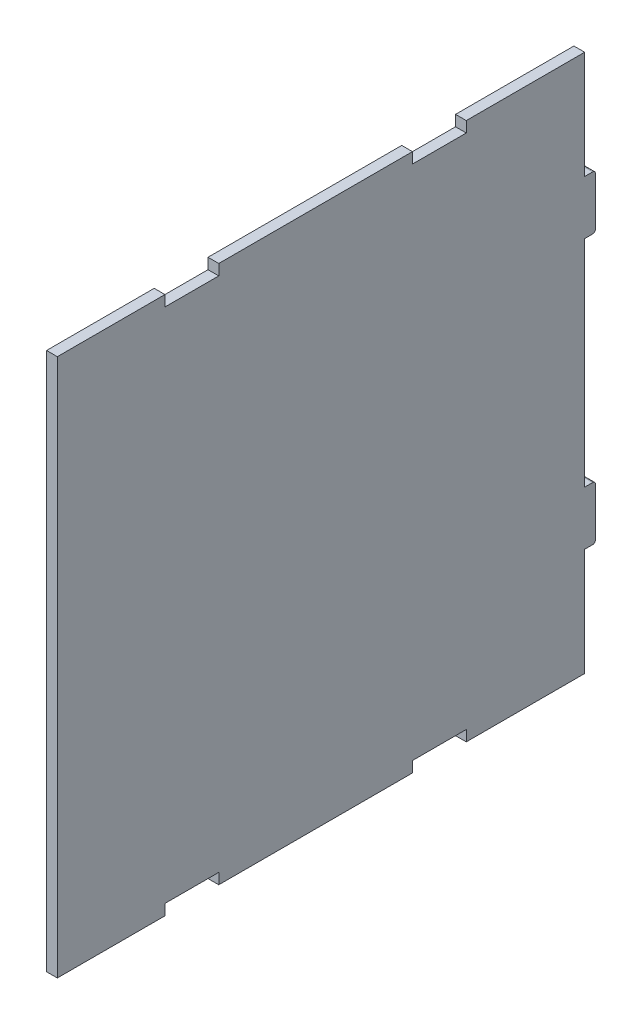
ISO-10303-21;
HEADER;
FILE_DESCRIPTION(('STEP AP214'),'2;1');
FILE_NAME('part.step','',(''),(''),'','','');
FILE_SCHEMA(('AUTOMOTIVE_DESIGN { 1 0 10303 214 1 1 1 1 }'));
ENDSEC;
DATA;
#1=APPLICATION_CONTEXT('core data for automotive mechanical design processes');
#2=APPLICATION_PROTOCOL_DEFINITION('international standard','automotive_design',2000,#1);
#3=PRODUCT_CONTEXT('',#1,'mechanical');
#4=PRODUCT('Part','Part','',(#3));
#5=PRODUCT_RELATED_PRODUCT_CATEGORY('part','',(#4));
#6=PRODUCT_DEFINITION_FORMATION('','',#4);
#7=PRODUCT_DEFINITION_CONTEXT('part definition',#1,'design');
#8=PRODUCT_DEFINITION('design','',#6,#7);
#9=PRODUCT_DEFINITION_SHAPE('','',#8);
#10=(LENGTH_UNIT() NAMED_UNIT(*) SI_UNIT(.MILLI.,.METRE.));
#11=(NAMED_UNIT(*) PLANE_ANGLE_UNIT() SI_UNIT($,.RADIAN.));
#12=(NAMED_UNIT(*) SI_UNIT($,.STERADIAN.) SOLID_ANGLE_UNIT());
#13=UNCERTAINTY_MEASURE_WITH_UNIT(LENGTH_MEASURE(1.E-05),#10,'distance_accuracy_value','');
#14=(GEOMETRIC_REPRESENTATION_CONTEXT(3) GLOBAL_UNCERTAINTY_ASSIGNED_CONTEXT((#13)) GLOBAL_UNIT_ASSIGNED_CONTEXT((#10,
#11,#12)) REPRESENTATION_CONTEXT('',''));
#15=CARTESIAN_POINT('',(0.,0.,0.));
#16=DIRECTION('',(0.,0.,1.));
#17=DIRECTION('',(1.,0.,0.));
#18=AXIS2_PLACEMENT_3D('',#15,#16,#17);
#19=CARTESIAN_POINT('',(50.,50.,98.));
#20=DIRECTION('',(-1.,0.,0.));
#21=DIRECTION('',(0.,0.,1.));
#22=AXIS2_PLACEMENT_3D('',#19,#20,#21);
#23=PLANE('',#22);
#24=DIRECTION('',(0.,0.,1.));
#25=VECTOR('',#24,1.);
#26=CARTESIAN_POINT('',(50.,-30.,-12.1980390271856));
#27=LINE('',#26,#25);
#28=CARTESIAN_POINT('',(50.,-30.,-1.5));
#29=VERTEX_POINT('',#28);
#30=CARTESIAN_POINT('',(50.,-30.,0.));
#31=VERTEX_POINT('',#30);
#32=EDGE_CURVE('E382',#29,#31,#27,.T.);
#33=ORIENTED_EDGE('',*,*,#32,.F.);
#34=CARTESIAN_POINT('',(50.,-29.5,-1.5));
#35=DIRECTION('',(-1.,0.,0.));
#36=DIRECTION('',(0.,0.,1.));
#37=AXIS2_PLACEMENT_3D('',#34,#35,#36);
#38=CIRCLE('',#37,0.5);
#39=CARTESIAN_POINT('',(50.,-29.5,-2.));
#40=VERTEX_POINT('',#39);
#41=EDGE_CURVE('E451',#29,#40,#38,.F.);
#42=ORIENTED_EDGE('',*,*,#41,.T.);
#43=DIRECTION('',(0.,1.,0.));
#44=VECTOR('',#43,1.);
#45=CARTESIAN_POINT('',(50.,-30.,-2.));
#46=LINE('',#45,#44);
#47=CARTESIAN_POINT('',(50.,-20.5,-2.));
#48=VERTEX_POINT('',#47);
#49=EDGE_CURVE('E381',#40,#48,#46,.T.);
#50=ORIENTED_EDGE('',*,*,#49,.T.);
#51=CARTESIAN_POINT('',(50.,-20.5,-1.5));
#52=DIRECTION('',(-1.,0.,0.));
#53=DIRECTION('',(0.,0.,1.));
#54=AXIS2_PLACEMENT_3D('',#51,#52,#53);
#55=CIRCLE('',#54,0.5);
#56=CARTESIAN_POINT('',(50.,-20.,-1.5));
#57=VERTEX_POINT('',#56);
#58=EDGE_CURVE('E449',#48,#57,#55,.F.);
#59=ORIENTED_EDGE('',*,*,#58,.T.);
#60=DIRECTION('',(0.,0.,1.));
#61=VECTOR('',#60,1.);
#62=CARTESIAN_POINT('',(50.,-20.,-12.1980390271856));
#63=LINE('',#62,#61);
#64=CARTESIAN_POINT('',(50.,-20.,0.));
#65=VERTEX_POINT('',#64);
#66=EDGE_CURVE('E391',#57,#65,#63,.T.);
#67=ORIENTED_EDGE('',*,*,#66,.T.);
#68=DIRECTION('',(0.,1.,0.));
#69=VECTOR('',#68,1.);
#70=CARTESIAN_POINT('',(50.,50.,0.));
#71=LINE('',#70,#69);
#72=CARTESIAN_POINT('',(50.,20.,0.));
#73=VERTEX_POINT('',#72);
#74=EDGE_CURVE('E413',#65,#73,#71,.T.);
#75=ORIENTED_EDGE('',*,*,#74,.T.);
#76=DIRECTION('',(0.,0.,1.));
#77=VECTOR('',#76,1.);
#78=CARTESIAN_POINT('',(50.,20.,-12.1980390271856));
#79=LINE('',#78,#77);
#80=CARTESIAN_POINT('',(50.,20.,-1.5));
#81=VERTEX_POINT('',#80);
#82=EDGE_CURVE('E361',#81,#73,#79,.T.);
#83=ORIENTED_EDGE('',*,*,#82,.F.);
#84=CARTESIAN_POINT('',(50.,20.5,-1.5));
#85=DIRECTION('',(-1.,0.,0.));
#86=DIRECTION('',(0.,0.,1.));
#87=AXIS2_PLACEMENT_3D('',#84,#85,#86);
#88=CIRCLE('',#87,0.5);
#89=CARTESIAN_POINT('',(50.,20.5,-2.));
#90=VERTEX_POINT('',#89);
#91=EDGE_CURVE('E447',#81,#90,#88,.F.);
#92=ORIENTED_EDGE('',*,*,#91,.T.);
#93=DIRECTION('',(0.,-1.,0.));
#94=VECTOR('',#93,1.);
#95=CARTESIAN_POINT('',(50.,30.,-2.));
#96=LINE('',#95,#94);
#97=CARTESIAN_POINT('',(50.,29.5,-2.));
#98=VERTEX_POINT('',#97);
#99=EDGE_CURVE('E360',#98,#90,#96,.T.);
#100=ORIENTED_EDGE('',*,*,#99,.F.);
#101=CARTESIAN_POINT('',(50.,29.5,-1.5));
#102=DIRECTION('',(-1.,0.,0.));
#103=DIRECTION('',(0.,0.,1.));
#104=AXIS2_PLACEMENT_3D('',#101,#102,#103);
#105=CIRCLE('',#104,0.5);
#106=CARTESIAN_POINT('',(50.,30.,-1.5));
#107=VERTEX_POINT('',#106);
#108=EDGE_CURVE('E445',#98,#107,#105,.F.);
#109=ORIENTED_EDGE('',*,*,#108,.T.);
#110=DIRECTION('',(0.,0.,1.));
#111=VECTOR('',#110,1.);
#112=CARTESIAN_POINT('',(50.,30.,-12.1980390271856));
#113=LINE('',#112,#111);
#114=CARTESIAN_POINT('',(50.,30.,0.));
#115=VERTEX_POINT('',#114);
#116=EDGE_CURVE('E371',#107,#115,#113,.T.);
#117=ORIENTED_EDGE('',*,*,#116,.T.);
#118=CARTESIAN_POINT('',(50.,50.,0.));
#119=VERTEX_POINT('',#118);
#120=EDGE_CURVE('E385',#115,#119,#71,.T.);
#121=ORIENTED_EDGE('',*,*,#120,.T.);
#122=DIRECTION('',(0.,0.,-1.));
#123=VECTOR('',#122,1.);
#124=CARTESIAN_POINT('',(50.,50.,98.));
#125=LINE('',#124,#123);
#126=CARTESIAN_POINT('',(50.,50.,22.));
#127=VERTEX_POINT('',#126);
#128=EDGE_CURVE('E436',#127,#119,#125,.T.);
#129=ORIENTED_EDGE('',*,*,#128,.F.);
#130=DIRECTION('',(0.,1.,0.));
#131=VECTOR('',#130,1.);
#132=CARTESIAN_POINT('',(50.,48.,22.));
#133=LINE('',#132,#131);
#134=CARTESIAN_POINT('',(50.,48.,22.));
#135=VERTEX_POINT('',#134);
#136=EDGE_CURVE('E267',#135,#127,#133,.T.);
#137=ORIENTED_EDGE('',*,*,#136,.F.);
#138=DIRECTION('',(0.,0.,-1.));
#139=VECTOR('',#138,1.);
#140=CARTESIAN_POINT('',(50.,48.,32.));
#141=LINE('',#140,#139);
#142=CARTESIAN_POINT('',(50.,48.,32.));
#143=VERTEX_POINT('',#142);
#144=EDGE_CURVE('E247',#143,#135,#141,.T.);
#145=ORIENTED_EDGE('',*,*,#144,.F.);
#146=DIRECTION('',(0.,-1.,0.));
#147=VECTOR('',#146,1.);
#148=CARTESIAN_POINT('',(50.,48.,32.));
#149=LINE('',#148,#147);
#150=CARTESIAN_POINT('',(50.,50.,32.));
#151=VERTEX_POINT('',#150);
#152=EDGE_CURVE('E257',#151,#143,#149,.T.);
#153=ORIENTED_EDGE('',*,*,#152,.F.);
#154=CARTESIAN_POINT('',(50.,50.,68.));
#155=VERTEX_POINT('',#154);
#156=EDGE_CURVE('E442',#155,#151,#125,.T.);
#157=ORIENTED_EDGE('',*,*,#156,.F.);
#158=DIRECTION('',(0.,-1.,0.));
#159=VECTOR('',#158,1.);
#160=CARTESIAN_POINT('',(50.,48.,68.));
#161=LINE('',#160,#159);
#162=CARTESIAN_POINT('',(50.,48.,68.));
#163=VERTEX_POINT('',#162);
#164=EDGE_CURVE('E291',#155,#163,#161,.T.);
#165=ORIENTED_EDGE('',*,*,#164,.T.);
#166=DIRECTION('',(0.,0.,1.));
#167=VECTOR('',#166,1.);
#168=CARTESIAN_POINT('',(50.,48.,68.));
#169=LINE('',#168,#167);
#170=CARTESIAN_POINT('',(50.,48.,78.));
#171=VERTEX_POINT('',#170);
#172=EDGE_CURVE('E269',#163,#171,#169,.T.);
#173=ORIENTED_EDGE('',*,*,#172,.T.);
#174=DIRECTION('',(0.,1.,0.));
#175=VECTOR('',#174,1.);
#176=CARTESIAN_POINT('',(50.,48.,78.));
#177=LINE('',#176,#175);
#178=CARTESIAN_POINT('',(50.,50.,78.));
#179=VERTEX_POINT('',#178);
#180=EDGE_CURVE('E294',#171,#179,#177,.T.);
#181=ORIENTED_EDGE('',*,*,#180,.T.);
#182=CARTESIAN_POINT('',(50.,50.,98.));
#183=VERTEX_POINT('',#182);
#184=EDGE_CURVE('E438',#183,#179,#125,.T.);
#185=ORIENTED_EDGE('',*,*,#184,.F.);
#186=DIRECTION('',(0.,1.,0.));
#187=VECTOR('',#186,1.);
#188=CARTESIAN_POINT('',(50.,50.,98.));
#189=LINE('',#188,#187);
#190=CARTESIAN_POINT('',(50.,-50.,98.));
#191=VERTEX_POINT('',#190);
#192=EDGE_CURVE('E398',#191,#183,#189,.T.);
#193=ORIENTED_EDGE('',*,*,#192,.F.);
#194=DIRECTION('',(0.,0.,-1.));
#195=VECTOR('',#194,1.);
#196=CARTESIAN_POINT('',(50.,-50.,98.));
#197=LINE('',#196,#195);
#198=CARTESIAN_POINT('',(50.,-50.,78.));
#199=VERTEX_POINT('',#198);
#200=EDGE_CURVE('E423',#191,#199,#197,.T.);
#201=ORIENTED_EDGE('',*,*,#200,.T.);
#202=DIRECTION('',(0.,1.,0.));
#203=VECTOR('',#202,1.);
#204=CARTESIAN_POINT('',(50.,-49.9999999999999,78.));
#205=LINE('',#204,#203);
#206=CARTESIAN_POINT('',(50.,-48.,78.));
#207=VERTEX_POINT('',#206);
#208=EDGE_CURVE('E342',#199,#207,#205,.T.);
#209=ORIENTED_EDGE('',*,*,#208,.T.);
#210=DIRECTION('',(0.,0.,-1.));
#211=VECTOR('',#210,1.);
#212=CARTESIAN_POINT('',(50.,-48.,78.));
#213=LINE('',#212,#211);
#214=CARTESIAN_POINT('',(50.,-48.,68.));
#215=VERTEX_POINT('',#214);
#216=EDGE_CURVE('E313',#207,#215,#213,.T.);
#217=ORIENTED_EDGE('',*,*,#216,.T.);
#218=DIRECTION('',(0.,-1.,0.));
#219=VECTOR('',#218,1.);
#220=CARTESIAN_POINT('',(50.,-49.9999999999999,68.));
#221=LINE('',#220,#219);
#222=CARTESIAN_POINT('',(50.,-50.,68.));
#223=VERTEX_POINT('',#222);
#224=EDGE_CURVE('E345',#215,#223,#221,.T.);
#225=ORIENTED_EDGE('',*,*,#224,.T.);
#226=CARTESIAN_POINT('',(50.,-50.,32.));
#227=VERTEX_POINT('',#226);
#228=EDGE_CURVE('E427',#223,#227,#197,.T.);
#229=ORIENTED_EDGE('',*,*,#228,.T.);
#230=DIRECTION('',(0.,-1.,0.));
#231=VECTOR('',#230,1.);
#232=CARTESIAN_POINT('',(50.,-49.9999999999999,32.));
#233=LINE('',#232,#231);
#234=CARTESIAN_POINT('',(50.,-48.,32.));
#235=VERTEX_POINT('',#234);
#236=EDGE_CURVE('E311',#235,#227,#233,.T.);
#237=ORIENTED_EDGE('',*,*,#236,.F.);
#238=DIRECTION('',(0.,0.,1.));
#239=VECTOR('',#238,1.);
#240=CARTESIAN_POINT('',(50.,-48.,22.));
#241=LINE('',#240,#239);
#242=CARTESIAN_POINT('',(50.,-48.,22.));
#243=VERTEX_POINT('',#242);
#244=EDGE_CURVE('E314',#243,#235,#241,.T.);
#245=ORIENTED_EDGE('',*,*,#244,.F.);
#246=DIRECTION('',(0.,1.,0.));
#247=VECTOR('',#246,1.);
#248=CARTESIAN_POINT('',(50.,-49.9999999999999,22.));
#249=LINE('',#248,#247);
#250=CARTESIAN_POINT('',(50.,-50.,22.));
#251=VERTEX_POINT('',#250);
#252=EDGE_CURVE('E307',#251,#243,#249,.T.);
#253=ORIENTED_EDGE('',*,*,#252,.F.);
#254=CARTESIAN_POINT('',(50.,-50.,0.));
#255=VERTEX_POINT('',#254);
#256=EDGE_CURVE('E408',#251,#255,#197,.T.);
#257=ORIENTED_EDGE('',*,*,#256,.T.);
#258=EDGE_CURVE('E409',#255,#31,#71,.T.);
#259=ORIENTED_EDGE('',*,*,#258,.T.);
#260=EDGE_LOOP('',(#33,#42,#50,#59,#67,#75,#83,#92,#100,#109,#117,#121,#129,#137,#145,#153,#157,
#165,#173,#181,#185,#193,#201,#209,#217,#225,#229,#237,#245,#253,#257,#259));
#261=FACE_BOUND('',#260,.T.);
#262=ADVANCED_FACE('F33',(#261),#23,.F.);
#263=CARTESIAN_POINT('',(48.,50.,98.));
#264=DIRECTION('',(1.,0.,0.));
#265=DIRECTION('',(0.,1.,0.));
#266=AXIS2_PLACEMENT_3D('',#263,#264,#265);
#267=PLANE('',#266);
#268=DIRECTION('',(0.,-1.,0.));
#269=VECTOR('',#268,1.);
#270=CARTESIAN_POINT('',(48.,-30.,-2.));
#271=LINE('',#270,#269);
#272=CARTESIAN_POINT('',(48.,-20.5,-2.));
#273=VERTEX_POINT('',#272);
#274=CARTESIAN_POINT('',(48.,-29.5,-2.));
#275=VERTEX_POINT('',#274);
#276=EDGE_CURVE('E378',#273,#275,#271,.T.);
#277=ORIENTED_EDGE('',*,*,#276,.T.);
#278=CARTESIAN_POINT('',(48.,-29.5,-1.5));
#279=DIRECTION('',(1.,0.,0.));
#280=DIRECTION('',(0.,1.,0.));
#281=AXIS2_PLACEMENT_3D('',#278,#279,#280);
#282=CIRCLE('',#281,0.5);
#283=CARTESIAN_POINT('',(48.,-30.,-1.5));
#284=VERTEX_POINT('',#283);
#285=EDGE_CURVE('E461',#275,#284,#282,.F.);
#286=ORIENTED_EDGE('',*,*,#285,.T.);
#287=DIRECTION('',(0.,0.,1.));
#288=VECTOR('',#287,1.);
#289=CARTESIAN_POINT('',(48.,-30.,-12.1980390271856));
#290=LINE('',#289,#288);
#291=CARTESIAN_POINT('',(48.,-30.,0.));
#292=VERTEX_POINT('',#291);
#293=EDGE_CURVE('E395',#284,#292,#290,.T.);
#294=ORIENTED_EDGE('',*,*,#293,.T.);
#295=DIRECTION('',(0.,-1.,0.));
#296=VECTOR('',#295,1.);
#297=CARTESIAN_POINT('',(48.,50.,0.));
#298=LINE('',#297,#296);
#299=CARTESIAN_POINT('',(48.,-50.,0.));
#300=VERTEX_POINT('',#299);
#301=EDGE_CURVE('E416',#292,#300,#298,.T.);
#302=ORIENTED_EDGE('',*,*,#301,.T.);
#303=DIRECTION('',(0.,0.,-1.));
#304=VECTOR('',#303,1.);
#305=CARTESIAN_POINT('',(48.,-50.,98.));
#306=LINE('',#305,#304);
#307=CARTESIAN_POINT('',(48.,-50.,22.));
#308=VERTEX_POINT('',#307);
#309=EDGE_CURVE('E426',#308,#300,#306,.T.);
#310=ORIENTED_EDGE('',*,*,#309,.F.);
#311=DIRECTION('',(0.,-1.,0.));
#312=VECTOR('',#311,1.);
#313=CARTESIAN_POINT('',(48.,-50.,22.));
#314=LINE('',#313,#312);
#315=CARTESIAN_POINT('',(48.,-48.,22.));
#316=VERTEX_POINT('',#315);
#317=EDGE_CURVE('E308',#316,#308,#314,.T.);
#318=ORIENTED_EDGE('',*,*,#317,.F.);
#319=DIRECTION('',(0.,0.,-1.));
#320=VECTOR('',#319,1.);
#321=CARTESIAN_POINT('',(48.,-48.,98.));
#322=LINE('',#321,#320);
#323=CARTESIAN_POINT('',(48.,-48.,32.));
#324=VERTEX_POINT('',#323);
#325=EDGE_CURVE('E337',#324,#316,#322,.T.);
#326=ORIENTED_EDGE('',*,*,#325,.F.);
#327=DIRECTION('',(0.,1.,0.));
#328=VECTOR('',#327,1.);
#329=CARTESIAN_POINT('',(48.,-50.,32.));
#330=LINE('',#329,#328);
#331=CARTESIAN_POINT('',(48.,-50.,32.));
#332=VERTEX_POINT('',#331);
#333=EDGE_CURVE('E305',#332,#324,#330,.T.);
#334=ORIENTED_EDGE('',*,*,#333,.F.);
#335=CARTESIAN_POINT('',(48.,-50.,68.0000000000001));
#336=VERTEX_POINT('',#335);
#337=EDGE_CURVE('E432',#336,#332,#306,.T.);
#338=ORIENTED_EDGE('',*,*,#337,.F.);
#339=DIRECTION('',(0.,1.,0.));
#340=VECTOR('',#339,1.);
#341=CARTESIAN_POINT('',(48.,-50.,68.));
#342=LINE('',#341,#340);
#343=CARTESIAN_POINT('',(48.,-48.,68.));
#344=VERTEX_POINT('',#343);
#345=EDGE_CURVE('E329',#336,#344,#342,.T.);
#346=ORIENTED_EDGE('',*,*,#345,.T.);
#347=CARTESIAN_POINT('',(48.,-48.,78.0000000000001));
#348=VERTEX_POINT('',#347);
#349=EDGE_CURVE('E356',#348,#344,#322,.T.);
#350=ORIENTED_EDGE('',*,*,#349,.F.);
#351=DIRECTION('',(0.,-1.,0.));
#352=VECTOR('',#351,1.);
#353=CARTESIAN_POINT('',(48.,-50.,78.));
#354=LINE('',#353,#352);
#355=CARTESIAN_POINT('',(48.,-50.,78.0000000000001));
#356=VERTEX_POINT('',#355);
#357=EDGE_CURVE('E334',#348,#356,#354,.T.);
#358=ORIENTED_EDGE('',*,*,#357,.T.);
#359=CARTESIAN_POINT('',(48.,-50.,98.));
#360=VERTEX_POINT('',#359);
#361=EDGE_CURVE('E428',#360,#356,#306,.T.);
#362=ORIENTED_EDGE('',*,*,#361,.F.);
#363=DIRECTION('',(0.,-1.,0.));
#364=VECTOR('',#363,1.);
#365=CARTESIAN_POINT('',(48.,50.,98.));
#366=LINE('',#365,#364);
#367=CARTESIAN_POINT('',(48.,50.,98.));
#368=VERTEX_POINT('',#367);
#369=EDGE_CURVE('E404',#368,#360,#366,.T.);
#370=ORIENTED_EDGE('',*,*,#369,.F.);
#371=DIRECTION('',(0.,0.,-1.));
#372=VECTOR('',#371,1.);
#373=CARTESIAN_POINT('',(48.,50.,98.));
#374=LINE('',#373,#372);
#375=CARTESIAN_POINT('',(48.,50.,78.));
#376=VERTEX_POINT('',#375);
#377=EDGE_CURVE('E433',#368,#376,#374,.T.);
#378=ORIENTED_EDGE('',*,*,#377,.T.);
#379=DIRECTION('',(0.,-1.,0.));
#380=VECTOR('',#379,1.);
#381=CARTESIAN_POINT('',(48.,48.,78.));
#382=LINE('',#381,#380);
#383=CARTESIAN_POINT('',(48.,48.,78.));
#384=VERTEX_POINT('',#383);
#385=EDGE_CURVE('E278',#376,#384,#382,.T.);
#386=ORIENTED_EDGE('',*,*,#385,.T.);
#387=DIRECTION('',(0.,0.,1.));
#388=VECTOR('',#387,1.);
#389=CARTESIAN_POINT('',(48.,48.,98.));
#390=LINE('',#389,#388);
#391=CARTESIAN_POINT('',(48.,48.,68.0000000000001));
#392=VERTEX_POINT('',#391);
#393=EDGE_CURVE('E286',#392,#384,#390,.T.);
#394=ORIENTED_EDGE('',*,*,#393,.F.);
#395=DIRECTION('',(0.,1.,0.));
#396=VECTOR('',#395,1.);
#397=CARTESIAN_POINT('',(48.,48.,68.));
#398=LINE('',#397,#396);
#399=CARTESIAN_POINT('',(48.,50.,68.0000000000001));
#400=VERTEX_POINT('',#399);
#401=EDGE_CURVE('E283',#392,#400,#398,.T.);
#402=ORIENTED_EDGE('',*,*,#401,.T.);
#403=CARTESIAN_POINT('',(48.,50.,32.));
#404=VERTEX_POINT('',#403);
#405=EDGE_CURVE('E437',#400,#404,#374,.T.);
#406=ORIENTED_EDGE('',*,*,#405,.T.);
#407=DIRECTION('',(0.,1.,0.));
#408=VECTOR('',#407,1.);
#409=CARTESIAN_POINT('',(48.,48.,32.));
#410=LINE('',#409,#408);
#411=CARTESIAN_POINT('',(48.,48.,32.));
#412=VERTEX_POINT('',#411);
#413=EDGE_CURVE('E276',#412,#404,#410,.T.);
#414=ORIENTED_EDGE('',*,*,#413,.F.);
#415=CARTESIAN_POINT('',(48.,48.,22.));
#416=VERTEX_POINT('',#415);
#417=EDGE_CURVE('E250',#416,#412,#390,.T.);
#418=ORIENTED_EDGE('',*,*,#417,.F.);
#419=DIRECTION('',(0.,-1.,0.));
#420=VECTOR('',#419,1.);
#421=CARTESIAN_POINT('',(48.,48.,22.));
#422=LINE('',#421,#420);
#423=CARTESIAN_POINT('',(48.,50.,22.));
#424=VERTEX_POINT('',#423);
#425=EDGE_CURVE('E263',#424,#416,#422,.T.);
#426=ORIENTED_EDGE('',*,*,#425,.F.);
#427=CARTESIAN_POINT('',(48.,50.,0.));
#428=VERTEX_POINT('',#427);
#429=EDGE_CURVE('E431',#424,#428,#374,.T.);
#430=ORIENTED_EDGE('',*,*,#429,.T.);
#431=CARTESIAN_POINT('',(48.,30.,0.));
#432=VERTEX_POINT('',#431);
#433=EDGE_CURVE('E417',#428,#432,#298,.T.);
#434=ORIENTED_EDGE('',*,*,#433,.T.);
#435=DIRECTION('',(0.,0.,1.));
#436=VECTOR('',#435,1.);
#437=CARTESIAN_POINT('',(48.,30.,-12.1980390271856));
#438=LINE('',#437,#436);
#439=CARTESIAN_POINT('',(48.,30.,-1.5));
#440=VERTEX_POINT('',#439);
#441=EDGE_CURVE('E373',#440,#432,#438,.T.);
#442=ORIENTED_EDGE('',*,*,#441,.F.);
#443=CARTESIAN_POINT('',(48.,29.5,-1.5));
#444=DIRECTION('',(1.,0.,0.));
#445=DIRECTION('',(0.,1.,0.));
#446=AXIS2_PLACEMENT_3D('',#443,#444,#445);
#447=CIRCLE('',#446,0.5);
#448=CARTESIAN_POINT('',(48.,29.5,-2.));
#449=VERTEX_POINT('',#448);
#450=EDGE_CURVE('E457',#440,#449,#447,.F.);
#451=ORIENTED_EDGE('',*,*,#450,.T.);
#452=DIRECTION('',(0.,1.,0.));
#453=VECTOR('',#452,1.);
#454=CARTESIAN_POINT('',(48.,30.,-2.));
#455=LINE('',#454,#453);
#456=CARTESIAN_POINT('',(48.,20.5,-2.));
#457=VERTEX_POINT('',#456);
#458=EDGE_CURVE('E357',#457,#449,#455,.T.);
#459=ORIENTED_EDGE('',*,*,#458,.F.);
#460=CARTESIAN_POINT('',(48.,20.5,-1.5));
#461=DIRECTION('',(1.,0.,0.));
#462=DIRECTION('',(0.,1.,0.));
#463=AXIS2_PLACEMENT_3D('',#460,#461,#462);
#464=CIRCLE('',#463,0.5);
#465=CARTESIAN_POINT('',(48.,20.,-1.5));
#466=VERTEX_POINT('',#465);
#467=EDGE_CURVE('E56',#457,#466,#464,.F.);
#468=ORIENTED_EDGE('',*,*,#467,.T.);
#469=DIRECTION('',(0.,0.,1.));
#470=VECTOR('',#469,1.);
#471=CARTESIAN_POINT('',(48.,20.,-12.1980390271856));
#472=LINE('',#471,#470);
#473=CARTESIAN_POINT('',(48.,20.,0.));
#474=VERTEX_POINT('',#473);
#475=EDGE_CURVE('E375',#466,#474,#472,.T.);
#476=ORIENTED_EDGE('',*,*,#475,.T.);
#477=CARTESIAN_POINT('',(48.,-20.,0.));
#478=VERTEX_POINT('',#477);
#479=EDGE_CURVE('E420',#474,#478,#298,.T.);
#480=ORIENTED_EDGE('',*,*,#479,.T.);
#481=DIRECTION('',(0.,0.,1.));
#482=VECTOR('',#481,1.);
#483=CARTESIAN_POINT('',(48.,-20.,-12.1980390271856));
#484=LINE('',#483,#482);
#485=CARTESIAN_POINT('',(48.,-20.,-1.5));
#486=VERTEX_POINT('',#485);
#487=EDGE_CURVE('E393',#486,#478,#484,.T.);
#488=ORIENTED_EDGE('',*,*,#487,.F.);
#489=CARTESIAN_POINT('',(48.,-20.5,-1.5));
#490=DIRECTION('',(1.,0.,0.));
#491=DIRECTION('',(0.,1.,0.));
#492=AXIS2_PLACEMENT_3D('',#489,#490,#491);
#493=CIRCLE('',#492,0.5);
#494=EDGE_CURVE('E48',#486,#273,#493,.F.);
#495=ORIENTED_EDGE('',*,*,#494,.T.);
#496=EDGE_LOOP('',(#277,#286,#294,#302,#310,#318,#326,#334,#338,#346,#350,#358,#362,#370,#378,
#386,#394,#402,#406,#414,#418,#426,#430,#434,#442,#451,#459,#468,#476,#480,#488,#495));
#497=FACE_BOUND('',#496,.T.);
#498=ADVANCED_FACE('F485',(#497),#267,.F.);
#499=CARTESIAN_POINT('',(50.,50.,98.));
#500=DIRECTION('',(0.,-1.,0.));
#501=DIRECTION('',(0.,0.,-1.));
#502=AXIS2_PLACEMENT_3D('',#499,#500,#501);
#503=PLANE('',#502);
#504=DIRECTION('',(-1.,0.,0.));
#505=VECTOR('',#504,1.);
#506=CARTESIAN_POINT('',(60.1980390271856,50.,78.));
#507=LINE('',#506,#505);
#508=EDGE_CURVE('E282',#179,#376,#507,.T.);
#509=ORIENTED_EDGE('',*,*,#508,.T.);
#510=ORIENTED_EDGE('',*,*,#377,.F.);
#511=DIRECTION('',(-1.,0.,0.));
#512=VECTOR('',#511,1.);
#513=CARTESIAN_POINT('',(50.,50.,98.));
#514=LINE('',#513,#512);
#515=EDGE_CURVE('E401',#183,#368,#514,.T.);
#516=ORIENTED_EDGE('',*,*,#515,.F.);
#517=ORIENTED_EDGE('',*,*,#184,.T.);
#518=EDGE_LOOP('',(#509,#510,#516,#517));
#519=FACE_BOUND('',#518,.T.);
#520=ADVANCED_FACE('F519',(#519),#503,.F.);
#521=DIRECTION('',(-1.,0.,0.));
#522=VECTOR('',#521,1.);
#523=CARTESIAN_POINT('',(60.1980390271856,50.,68.));
#524=LINE('',#523,#522);
#525=EDGE_CURVE('E281',#155,#400,#524,.T.);
#526=ORIENTED_EDGE('',*,*,#525,.F.);
#527=ORIENTED_EDGE('',*,*,#156,.T.);
#528=DIRECTION('',(-1.,0.,0.));
#529=VECTOR('',#528,1.);
#530=CARTESIAN_POINT('',(60.1980390271856,50.,32.));
#531=LINE('',#530,#529);
#532=EDGE_CURVE('E254',#151,#404,#531,.T.);
#533=ORIENTED_EDGE('',*,*,#532,.T.);
#534=ORIENTED_EDGE('',*,*,#405,.F.);
#535=EDGE_LOOP('',(#526,#527,#533,#534));
#536=FACE_BOUND('',#535,.T.);
#537=ADVANCED_FACE('F504',(#536),#503,.F.);
#538=CARTESIAN_POINT('',(50.,-50.,98.));
#539=DIRECTION('',(0.,1.,0.));
#540=DIRECTION('',(0.,0.,1.));
#541=AXIS2_PLACEMENT_3D('',#538,#539,#540);
#542=PLANE('',#541);
#543=DIRECTION('',(-1.,0.,0.));
#544=VECTOR('',#543,1.);
#545=CARTESIAN_POINT('',(60.1980390271856,-49.9999999999999,68.));
#546=LINE('',#545,#544);
#547=EDGE_CURVE('E333',#223,#336,#546,.T.);
#548=ORIENTED_EDGE('',*,*,#547,.T.);
#549=ORIENTED_EDGE('',*,*,#337,.T.);
#550=DIRECTION('',(-1.,0.,0.));
#551=VECTOR('',#550,1.);
#552=CARTESIAN_POINT('',(60.1980390271856,-49.9999999999999,32.));
#553=LINE('',#552,#551);
#554=EDGE_CURVE('E310',#227,#332,#553,.T.);
#555=ORIENTED_EDGE('',*,*,#554,.F.);
#556=ORIENTED_EDGE('',*,*,#228,.F.);
#557=EDGE_LOOP('',(#548,#549,#555,#556));
#558=FACE_BOUND('',#557,.T.);
#559=ADVANCED_FACE('F545',(#558),#542,.F.);
#560=DIRECTION('',(-1.,0.,0.));
#561=VECTOR('',#560,1.);
#562=CARTESIAN_POINT('',(60.1980390271856,-49.9999999999999,78.));
#563=LINE('',#562,#561);
#564=EDGE_CURVE('E332',#199,#356,#563,.T.);
#565=ORIENTED_EDGE('',*,*,#564,.F.);
#566=ORIENTED_EDGE('',*,*,#200,.F.);
#567=DIRECTION('',(1.,0.,0.));
#568=VECTOR('',#567,1.);
#569=CARTESIAN_POINT('',(50.,-50.,98.));
#570=LINE('',#569,#568);
#571=EDGE_CURVE('E406',#360,#191,#570,.T.);
#572=ORIENTED_EDGE('',*,*,#571,.F.);
#573=ORIENTED_EDGE('',*,*,#361,.T.);
#574=EDGE_LOOP('',(#565,#566,#572,#573));
#575=FACE_BOUND('',#574,.T.);
#576=ADVANCED_FACE('F529',(#575),#542,.F.);
#577=ORIENTED_EDGE('',*,*,#256,.F.);
#578=DIRECTION('',(-1.,0.,0.));
#579=VECTOR('',#578,1.);
#580=CARTESIAN_POINT('',(60.1980390271856,-49.9999999999999,22.));
#581=LINE('',#580,#579);
#582=EDGE_CURVE('E323',#251,#308,#581,.T.);
#583=ORIENTED_EDGE('',*,*,#582,.T.);
#584=ORIENTED_EDGE('',*,*,#309,.T.);
#585=DIRECTION('',(1.,0.,0.));
#586=VECTOR('',#585,1.);
#587=CARTESIAN_POINT('',(50.,-50.,0.));
#588=LINE('',#587,#586);
#589=EDGE_CURVE('E402',#300,#255,#588,.T.);
#590=ORIENTED_EDGE('',*,*,#589,.T.);
#591=EDGE_LOOP('',(#577,#583,#584,#590));
#592=FACE_BOUND('',#591,.T.);
#593=ADVANCED_FACE('F554',(#592),#542,.F.);
#594=CARTESIAN_POINT('',(0.,0.,0.));
#595=DIRECTION('',(0.,0.,-1.));
#596=DIRECTION('',(-1.,0.,0.));
#597=AXIS2_PLACEMENT_3D('',#594,#595,#596);
#598=PLANE('',#597);
#599=DIRECTION('',(1.,0.,0.));
#600=VECTOR('',#599,1.);
#601=CARTESIAN_POINT('',(50.,20.,0.));
#602=LINE('',#601,#600);
#603=EDGE_CURVE('E365',#474,#73,#602,.T.);
#604=ORIENTED_EDGE('',*,*,#603,.T.);
#605=ORIENTED_EDGE('',*,*,#74,.F.);
#606=DIRECTION('',(1.,0.,0.));
#607=VECTOR('',#606,1.);
#608=CARTESIAN_POINT('',(50.,-20.,0.));
#609=LINE('',#608,#607);
#610=EDGE_CURVE('E388',#478,#65,#609,.T.);
#611=ORIENTED_EDGE('',*,*,#610,.F.);
#612=ORIENTED_EDGE('',*,*,#479,.F.);
#613=EDGE_LOOP('',(#604,#605,#611,#612));
#614=FACE_BOUND('',#613,.T.);
#615=ADVANCED_FACE('F582',(#614),#598,.T.);
#616=DIRECTION('',(-1.,0.,0.));
#617=VECTOR('',#616,1.);
#618=CARTESIAN_POINT('',(50.,30.,0.));
#619=LINE('',#618,#617);
#620=EDGE_CURVE('E368',#115,#432,#619,.T.);
#621=ORIENTED_EDGE('',*,*,#620,.T.);
#622=ORIENTED_EDGE('',*,*,#433,.F.);
#623=DIRECTION('',(-1.,0.,0.));
#624=VECTOR('',#623,1.);
#625=CARTESIAN_POINT('',(50.,50.,0.));
#626=LINE('',#625,#624);
#627=EDGE_CURVE('E412',#119,#428,#626,.T.);
#628=ORIENTED_EDGE('',*,*,#627,.F.);
#629=ORIENTED_EDGE('',*,*,#120,.F.);
#630=EDGE_LOOP('',(#621,#622,#628,#629));
#631=FACE_BOUND('',#630,.T.);
#632=ADVANCED_FACE('F499',(#631),#598,.T.);
#633=ORIENTED_EDGE('',*,*,#429,.F.);
#634=DIRECTION('',(-1.,0.,0.));
#635=VECTOR('',#634,1.);
#636=CARTESIAN_POINT('',(60.1980390271856,50.,22.));
#637=LINE('',#636,#635);
#638=EDGE_CURVE('E274',#127,#424,#637,.T.);
#639=ORIENTED_EDGE('',*,*,#638,.F.);
#640=ORIENTED_EDGE('',*,*,#128,.T.);
#641=ORIENTED_EDGE('',*,*,#627,.T.);
#642=EDGE_LOOP('',(#633,#639,#640,#641));
#643=FACE_BOUND('',#642,.T.);
#644=ADVANCED_FACE('F611',(#643),#503,.F.);
#645=CARTESIAN_POINT('',(0.,0.,98.));
#646=DIRECTION('',(0.,0.,-1.));
#647=DIRECTION('',(-1.,0.,0.));
#648=AXIS2_PLACEMENT_3D('',#645,#646,#647);
#649=PLANE('',#648);
#650=ORIENTED_EDGE('',*,*,#192,.T.);
#651=ORIENTED_EDGE('',*,*,#515,.T.);
#652=ORIENTED_EDGE('',*,*,#369,.T.);
#653=ORIENTED_EDGE('',*,*,#571,.T.);
#654=EDGE_LOOP('',(#650,#651,#652,#653));
#655=FACE_BOUND('',#654,.T.);
#656=ADVANCED_FACE('F524',(#655),#649,.F.);
#657=DIRECTION('',(-1.,0.,0.));
#658=VECTOR('',#657,1.);
#659=CARTESIAN_POINT('',(50.,-30.,0.));
#660=LINE('',#659,#658);
#661=EDGE_CURVE('E364',#31,#292,#660,.T.);
#662=ORIENTED_EDGE('',*,*,#661,.F.);
#663=ORIENTED_EDGE('',*,*,#258,.F.);
#664=ORIENTED_EDGE('',*,*,#589,.F.);
#665=ORIENTED_EDGE('',*,*,#301,.F.);
#666=EDGE_LOOP('',(#662,#663,#664,#665));
#667=FACE_BOUND('',#666,.T.);
#668=ADVANCED_FACE('F559',(#667),#598,.T.);
#669=CARTESIAN_POINT('',(50.,-20.,-12.1980390271856));
#670=DIRECTION('',(0.,-1.,0.));
#671=DIRECTION('',(0.,0.,-1.));
#672=AXIS2_PLACEMENT_3D('',#669,#670,#671);
#673=PLANE('',#672);
#674=ORIENTED_EDGE('',*,*,#66,.F.);
#675=DIRECTION('',(-1.,0.,0.));
#676=VECTOR('',#675,1.);
#677=CARTESIAN_POINT('',(50.,-20.,-1.5));
#678=LINE('',#677,#676);
#679=EDGE_CURVE('E463',#57,#486,#678,.T.);
#680=ORIENTED_EDGE('',*,*,#679,.T.);
#681=ORIENTED_EDGE('',*,*,#487,.T.);
#682=ORIENTED_EDGE('',*,*,#610,.T.);
#683=EDGE_LOOP('',(#674,#680,#681,#682));
#684=FACE_BOUND('',#683,.T.);
#685=ADVANCED_FACE('F577',(#684),#673,.F.);
#686=CARTESIAN_POINT('',(50.,-30.,-12.1980390271856));
#687=DIRECTION('',(0.,1.,0.));
#688=DIRECTION('',(0.,0.,1.));
#689=AXIS2_PLACEMENT_3D('',#686,#687,#688);
#690=PLANE('',#689);
#691=ORIENTED_EDGE('',*,*,#293,.F.);
#692=DIRECTION('',(1.,0.,0.));
#693=VECTOR('',#692,1.);
#694=CARTESIAN_POINT('',(50.,-30.,-1.5));
#695=LINE('',#694,#693);
#696=EDGE_CURVE('E441',#284,#29,#695,.T.);
#697=ORIENTED_EDGE('',*,*,#696,.T.);
#698=ORIENTED_EDGE('',*,*,#32,.T.);
#699=ORIENTED_EDGE('',*,*,#661,.T.);
#700=EDGE_LOOP('',(#691,#697,#698,#699));
#701=FACE_BOUND('',#700,.T.);
#702=ADVANCED_FACE('F562',(#701),#690,.F.);
#703=CARTESIAN_POINT('',(0.,0.,-2.));
#704=DIRECTION('',(0.,0.,1.));
#705=DIRECTION('',(0.,-1.,0.));
#706=AXIS2_PLACEMENT_3D('',#703,#704,#705);
#707=PLANE('',#706);
#708=ORIENTED_EDGE('',*,*,#49,.F.);
#709=DIRECTION('',(1.,0.,0.));
#710=VECTOR('',#709,1.);
#711=CARTESIAN_POINT('',(0.,-29.5,-2.));
#712=LINE('',#711,#710);
#713=EDGE_CURVE('E455',#40,#275,#712,.F.);
#714=ORIENTED_EDGE('',*,*,#713,.T.);
#715=ORIENTED_EDGE('',*,*,#276,.F.);
#716=DIRECTION('',(-1.,0.,0.));
#717=VECTOR('',#716,1.);
#718=CARTESIAN_POINT('',(0.,-20.5,-2.));
#719=LINE('',#718,#717);
#720=EDGE_CURVE('E453',#273,#48,#719,.F.);
#721=ORIENTED_EDGE('',*,*,#720,.T.);
#722=EDGE_LOOP('',(#708,#714,#715,#721));
#723=FACE_BOUND('',#722,.T.);
#724=ADVANCED_FACE('F569',(#723),#707,.F.);
#725=CARTESIAN_POINT('',(50.,20.,-12.1980390271856));
#726=DIRECTION('',(0.,-1.,0.));
#727=DIRECTION('',(0.,0.,-1.));
#728=AXIS2_PLACEMENT_3D('',#725,#726,#727);
#729=PLANE('',#728);
#730=ORIENTED_EDGE('',*,*,#475,.F.);
#731=DIRECTION('',(-1.,0.,0.));
#732=VECTOR('',#731,1.);
#733=CARTESIAN_POINT('',(50.,20.,-1.5));
#734=LINE('',#733,#732);
#735=EDGE_CURVE('E41',#466,#81,#734,.F.);
#736=ORIENTED_EDGE('',*,*,#735,.T.);
#737=ORIENTED_EDGE('',*,*,#82,.T.);
#738=ORIENTED_EDGE('',*,*,#603,.F.);
#739=EDGE_LOOP('',(#730,#736,#737,#738));
#740=FACE_BOUND('',#739,.T.);
#741=ADVANCED_FACE('F473',(#740),#729,.T.);
#742=CARTESIAN_POINT('',(50.,30.,-12.1980390271856));
#743=DIRECTION('',(0.,1.,0.));
#744=DIRECTION('',(0.,0.,1.));
#745=AXIS2_PLACEMENT_3D('',#742,#743,#744);
#746=PLANE('',#745);
#747=ORIENTED_EDGE('',*,*,#116,.F.);
#748=DIRECTION('',(1.,0.,0.));
#749=VECTOR('',#748,1.);
#750=CARTESIAN_POINT('',(48.,30.,-1.5));
#751=LINE('',#750,#749);
#752=EDGE_CURVE('E11',#107,#440,#751,.F.);
#753=ORIENTED_EDGE('',*,*,#752,.T.);
#754=ORIENTED_EDGE('',*,*,#441,.T.);
#755=ORIENTED_EDGE('',*,*,#620,.F.);
#756=EDGE_LOOP('',(#747,#753,#754,#755));
#757=FACE_BOUND('',#756,.T.);
#758=ADVANCED_FACE('F494',(#757),#746,.T.);
#759=CARTESIAN_POINT('',(0.,0.,-2.));
#760=DIRECTION('',(0.,0.,1.));
#761=DIRECTION('',(0.,-1.,0.));
#762=AXIS2_PLACEMENT_3D('',#759,#760,#761);
#763=PLANE('',#762);
#764=ORIENTED_EDGE('',*,*,#99,.T.);
#765=DIRECTION('',(-1.,0.,0.));
#766=VECTOR('',#765,1.);
#767=CARTESIAN_POINT('',(48.,20.5,-2.));
#768=LINE('',#767,#766);
#769=EDGE_CURVE('E468',#90,#457,#768,.T.);
#770=ORIENTED_EDGE('',*,*,#769,.T.);
#771=ORIENTED_EDGE('',*,*,#458,.T.);
#772=DIRECTION('',(1.,0.,0.));
#773=VECTOR('',#772,1.);
#774=CARTESIAN_POINT('',(50.,29.5,-2.));
#775=LINE('',#774,#773);
#776=EDGE_CURVE('E465',#449,#98,#775,.T.);
#777=ORIENTED_EDGE('',*,*,#776,.T.);
#778=EDGE_LOOP('',(#764,#770,#771,#777));
#779=FACE_BOUND('',#778,.T.);
#780=ADVANCED_FACE('F483',(#779),#763,.F.);
#781=CARTESIAN_POINT('',(60.1980390271856,-49.9999999999999,22.));
#782=DIRECTION('',(0.,0.,-1.));
#783=DIRECTION('',(-1.,0.,0.));
#784=AXIS2_PLACEMENT_3D('',#781,#782,#783);
#785=PLANE('',#784);
#786=ORIENTED_EDGE('',*,*,#252,.T.);
#787=DIRECTION('',(-1.,0.,0.));
#788=VECTOR('',#787,1.);
#789=CARTESIAN_POINT('',(60.1980390271856,-47.9999999999999,22.));
#790=LINE('',#789,#788);
#791=EDGE_CURVE('E319',#243,#316,#790,.T.);
#792=ORIENTED_EDGE('',*,*,#791,.T.);
#793=ORIENTED_EDGE('',*,*,#317,.T.);
#794=ORIENTED_EDGE('',*,*,#582,.F.);
#795=EDGE_LOOP('',(#786,#792,#793,#794));
#796=FACE_BOUND('',#795,.T.);
#797=ADVANCED_FACE('F591',(#796),#785,.F.);
#798=CARTESIAN_POINT('',(60.1980390271856,-49.9999999999999,32.));
#799=DIRECTION('',(0.,0.,1.));
#800=DIRECTION('',(1.,0.,0.));
#801=AXIS2_PLACEMENT_3D('',#798,#799,#800);
#802=PLANE('',#801);
#803=ORIENTED_EDGE('',*,*,#236,.T.);
#804=ORIENTED_EDGE('',*,*,#554,.T.);
#805=ORIENTED_EDGE('',*,*,#333,.T.);
#806=DIRECTION('',(-1.,0.,0.));
#807=VECTOR('',#806,1.);
#808=CARTESIAN_POINT('',(60.1980390271856,-47.9999999999999,32.));
#809=LINE('',#808,#807);
#810=EDGE_CURVE('E322',#235,#324,#809,.T.);
#811=ORIENTED_EDGE('',*,*,#810,.F.);
#812=EDGE_LOOP('',(#803,#804,#805,#811));
#813=FACE_BOUND('',#812,.T.);
#814=ADVANCED_FACE('F587',(#813),#802,.F.);
#815=CARTESIAN_POINT('',(-48.,-48.,194.020831073262));
#816=DIRECTION('',(0.,-1.,0.));
#817=DIRECTION('',(0.,0.,-1.));
#818=AXIS2_PLACEMENT_3D('',#815,#816,#817);
#819=PLANE('',#818);
#820=ORIENTED_EDGE('',*,*,#325,.T.);
#821=ORIENTED_EDGE('',*,*,#791,.F.);
#822=ORIENTED_EDGE('',*,*,#244,.T.);
#823=ORIENTED_EDGE('',*,*,#810,.T.);
#824=EDGE_LOOP('',(#820,#821,#822,#823));
#825=FACE_BOUND('',#824,.T.);
#826=ADVANCED_FACE('F589',(#825),#819,.T.);
#827=ORIENTED_EDGE('',*,*,#349,.T.);
#828=DIRECTION('',(-1.,0.,0.));
#829=VECTOR('',#828,1.);
#830=CARTESIAN_POINT('',(60.1980390271856,-47.9999999999999,68.));
#831=LINE('',#830,#829);
#832=EDGE_CURVE('E341',#215,#344,#831,.T.);
#833=ORIENTED_EDGE('',*,*,#832,.F.);
#834=ORIENTED_EDGE('',*,*,#216,.F.);
#835=DIRECTION('',(-1.,0.,0.));
#836=VECTOR('',#835,1.);
#837=CARTESIAN_POINT('',(60.1980390271856,-47.9999999999999,78.));
#838=LINE('',#837,#836);
#839=EDGE_CURVE('E338',#207,#348,#838,.T.);
#840=ORIENTED_EDGE('',*,*,#839,.T.);
#841=EDGE_LOOP('',(#827,#833,#834,#840));
#842=FACE_BOUND('',#841,.T.);
#843=ADVANCED_FACE('F537',(#842),#819,.T.);
#844=CARTESIAN_POINT('',(60.1980390271856,-49.9999999999999,68.));
#845=DIRECTION('',(0.,0.,1.));
#846=DIRECTION('',(1.,0.,0.));
#847=AXIS2_PLACEMENT_3D('',#844,#845,#846);
#848=PLANE('',#847);
#849=ORIENTED_EDGE('',*,*,#832,.T.);
#850=ORIENTED_EDGE('',*,*,#345,.F.);
#851=ORIENTED_EDGE('',*,*,#547,.F.);
#852=ORIENTED_EDGE('',*,*,#224,.F.);
#853=EDGE_LOOP('',(#849,#850,#851,#852));
#854=FACE_BOUND('',#853,.T.);
#855=ADVANCED_FACE('F539',(#854),#848,.T.);
#856=CARTESIAN_POINT('',(60.1980390271856,-49.9999999999999,78.));
#857=DIRECTION('',(0.,0.,-1.));
#858=DIRECTION('',(-1.,0.,0.));
#859=AXIS2_PLACEMENT_3D('',#856,#857,#858);
#860=PLANE('',#859);
#861=ORIENTED_EDGE('',*,*,#564,.T.);
#862=ORIENTED_EDGE('',*,*,#357,.F.);
#863=ORIENTED_EDGE('',*,*,#839,.F.);
#864=ORIENTED_EDGE('',*,*,#208,.F.);
#865=EDGE_LOOP('',(#861,#862,#863,#864));
#866=FACE_BOUND('',#865,.T.);
#867=ADVANCED_FACE('F531',(#866),#860,.T.);
#868=CARTESIAN_POINT('',(60.1980390271856,48.,32.));
#869=DIRECTION('',(0.,0.,1.));
#870=DIRECTION('',(1.,0.,0.));
#871=AXIS2_PLACEMENT_3D('',#868,#869,#870);
#872=PLANE('',#871);
#873=ORIENTED_EDGE('',*,*,#152,.T.);
#874=DIRECTION('',(-1.,0.,0.));
#875=VECTOR('',#874,1.);
#876=CARTESIAN_POINT('',(60.1980390271856,48.,32.));
#877=LINE('',#876,#875);
#878=EDGE_CURVE('E242',#143,#412,#877,.T.);
#879=ORIENTED_EDGE('',*,*,#878,.T.);
#880=ORIENTED_EDGE('',*,*,#413,.T.);
#881=ORIENTED_EDGE('',*,*,#532,.F.);
#882=EDGE_LOOP('',(#873,#879,#880,#881));
#883=FACE_BOUND('',#882,.T.);
#884=ADVANCED_FACE('F258',(#883),#872,.F.);
#885=CARTESIAN_POINT('',(60.1980390271856,48.,22.));
#886=DIRECTION('',(0.,0.,-1.));
#887=DIRECTION('',(0.,1.,0.));
#888=AXIS2_PLACEMENT_3D('',#885,#886,#887);
#889=PLANE('',#888);
#890=ORIENTED_EDGE('',*,*,#136,.T.);
#891=ORIENTED_EDGE('',*,*,#638,.T.);
#892=ORIENTED_EDGE('',*,*,#425,.T.);
#893=DIRECTION('',(-1.,0.,0.));
#894=VECTOR('',#893,1.);
#895=CARTESIAN_POINT('',(60.1980390271856,48.,22.));
#896=LINE('',#895,#894);
#897=EDGE_CURVE('E253',#135,#416,#896,.T.);
#898=ORIENTED_EDGE('',*,*,#897,.F.);
#899=EDGE_LOOP('',(#890,#891,#892,#898));
#900=FACE_BOUND('',#899,.T.);
#901=ADVANCED_FACE('F789',(#900),#889,.F.);
#902=CARTESIAN_POINT('',(-48.,48.,194.020831073262));
#903=DIRECTION('',(0.,1.,0.));
#904=DIRECTION('',(0.,0.,1.));
#905=AXIS2_PLACEMENT_3D('',#902,#903,#904);
#906=PLANE('',#905);
#907=ORIENTED_EDGE('',*,*,#417,.T.);
#908=ORIENTED_EDGE('',*,*,#878,.F.);
#909=ORIENTED_EDGE('',*,*,#144,.T.);
#910=ORIENTED_EDGE('',*,*,#897,.T.);
#911=EDGE_LOOP('',(#907,#908,#909,#910));
#912=FACE_BOUND('',#911,.T.);
#913=ADVANCED_FACE('F244',(#912),#906,.T.);
#914=ORIENTED_EDGE('',*,*,#393,.T.);
#915=DIRECTION('',(-1.,0.,0.));
#916=VECTOR('',#915,1.);
#917=CARTESIAN_POINT('',(60.1980390271856,48.,78.));
#918=LINE('',#917,#916);
#919=EDGE_CURVE('E290',#171,#384,#918,.T.);
#920=ORIENTED_EDGE('',*,*,#919,.F.);
#921=ORIENTED_EDGE('',*,*,#172,.F.);
#922=DIRECTION('',(-1.,0.,0.));
#923=VECTOR('',#922,1.);
#924=CARTESIAN_POINT('',(60.1980390271856,48.,68.));
#925=LINE('',#924,#923);
#926=EDGE_CURVE('E287',#163,#392,#925,.T.);
#927=ORIENTED_EDGE('',*,*,#926,.T.);
#928=EDGE_LOOP('',(#914,#920,#921,#927));
#929=FACE_BOUND('',#928,.T.);
#930=ADVANCED_FACE('F512',(#929),#906,.T.);
#931=CARTESIAN_POINT('',(60.1980390271856,48.,78.));
#932=DIRECTION('',(0.,0.,-1.));
#933=DIRECTION('',(0.,1.,0.));
#934=AXIS2_PLACEMENT_3D('',#931,#932,#933);
#935=PLANE('',#934);
#936=ORIENTED_EDGE('',*,*,#919,.T.);
#937=ORIENTED_EDGE('',*,*,#385,.F.);
#938=ORIENTED_EDGE('',*,*,#508,.F.);
#939=ORIENTED_EDGE('',*,*,#180,.F.);
#940=EDGE_LOOP('',(#936,#937,#938,#939));
#941=FACE_BOUND('',#940,.T.);
#942=ADVANCED_FACE('F517',(#941),#935,.T.);
#943=CARTESIAN_POINT('',(60.1980390271856,48.,68.));
#944=DIRECTION('',(0.,0.,1.));
#945=DIRECTION('',(1.,0.,0.));
#946=AXIS2_PLACEMENT_3D('',#943,#944,#945);
#947=PLANE('',#946);
#948=ORIENTED_EDGE('',*,*,#525,.T.);
#949=ORIENTED_EDGE('',*,*,#401,.F.);
#950=ORIENTED_EDGE('',*,*,#926,.F.);
#951=ORIENTED_EDGE('',*,*,#164,.F.);
#952=EDGE_LOOP('',(#948,#949,#950,#951));
#953=FACE_BOUND('',#952,.T.);
#954=ADVANCED_FACE('F509',(#953),#947,.T.);
#955=CARTESIAN_POINT('',(50.,-29.5,-1.5));
#956=DIRECTION('',(1.,0.,0.));
#957=DIRECTION('',(0.,0.,-1.));
#958=AXIS2_PLACEMENT_3D('',#955,#956,#957);
#959=CYLINDRICAL_SURFACE('',#958,0.5);
#960=ORIENTED_EDGE('',*,*,#285,.F.);
#961=ORIENTED_EDGE('',*,*,#713,.F.);
#962=ORIENTED_EDGE('',*,*,#41,.F.);
#963=ORIENTED_EDGE('',*,*,#696,.F.);
#964=EDGE_LOOP('',(#960,#961,#962,#963));
#965=FACE_BOUND('',#964,.T.);
#966=ADVANCED_FACE('F572',(#965),#959,.T.);
#967=CARTESIAN_POINT('',(50.,-20.5,-1.5));
#968=DIRECTION('',(-1.,0.,0.));
#969=DIRECTION('',(0.,0.,1.));
#970=AXIS2_PLACEMENT_3D('',#967,#968,#969);
#971=CYLINDRICAL_SURFACE('',#970,0.5);
#972=ORIENTED_EDGE('',*,*,#58,.F.);
#973=ORIENTED_EDGE('',*,*,#720,.F.);
#974=ORIENTED_EDGE('',*,*,#494,.F.);
#975=ORIENTED_EDGE('',*,*,#679,.F.);
#976=EDGE_LOOP('',(#972,#973,#974,#975));
#977=FACE_BOUND('',#976,.T.);
#978=ADVANCED_FACE('F574',(#977),#971,.T.);
#979=CARTESIAN_POINT('',(0.,20.5,-1.5));
#980=DIRECTION('',(1.,0.,0.));
#981=DIRECTION('',(0.,0.,-1.));
#982=AXIS2_PLACEMENT_3D('',#979,#980,#981);
#983=CYLINDRICAL_SURFACE('',#982,0.5);
#984=ORIENTED_EDGE('',*,*,#91,.F.);
#985=ORIENTED_EDGE('',*,*,#735,.F.);
#986=ORIENTED_EDGE('',*,*,#467,.F.);
#987=ORIENTED_EDGE('',*,*,#769,.F.);
#988=EDGE_LOOP('',(#984,#985,#986,#987));
#989=FACE_BOUND('',#988,.T.);
#990=ADVANCED_FACE('F481',(#989),#983,.T.);
#991=CARTESIAN_POINT('',(0.,29.5,-1.5));
#992=DIRECTION('',(-1.,0.,0.));
#993=DIRECTION('',(0.,0.,1.));
#994=AXIS2_PLACEMENT_3D('',#991,#992,#993);
#995=CYLINDRICAL_SURFACE('',#994,0.5);
#996=ORIENTED_EDGE('',*,*,#450,.F.);
#997=ORIENTED_EDGE('',*,*,#752,.F.);
#998=ORIENTED_EDGE('',*,*,#108,.F.);
#999=ORIENTED_EDGE('',*,*,#776,.F.);
#1000=EDGE_LOOP('',(#996,#997,#998,#999));
#1001=FACE_BOUND('',#1000,.T.);
#1002=ADVANCED_FACE('F35',(#1001),#995,.T.);
#1003=CLOSED_SHELL('',(#262,#498,#520,#537,#559,#576,#593,#615,#632,#644,#656,#668,#685,#702,
#724,#741,#758,#780,#797,#814,#826,#843,#855,#867,#884,#901,#913,#930,#942,#954,#966,#978,#990,#1002));
#1004=MANIFOLD_SOLID_BREP('B2',#1003);
#1005=ADVANCED_BREP_SHAPE_REPRESENTATION('',(#18,#1004),#14);
#1006=SHAPE_DEFINITION_REPRESENTATION(#9,#1005);
ENDSEC;
END-ISO-10303-21;
